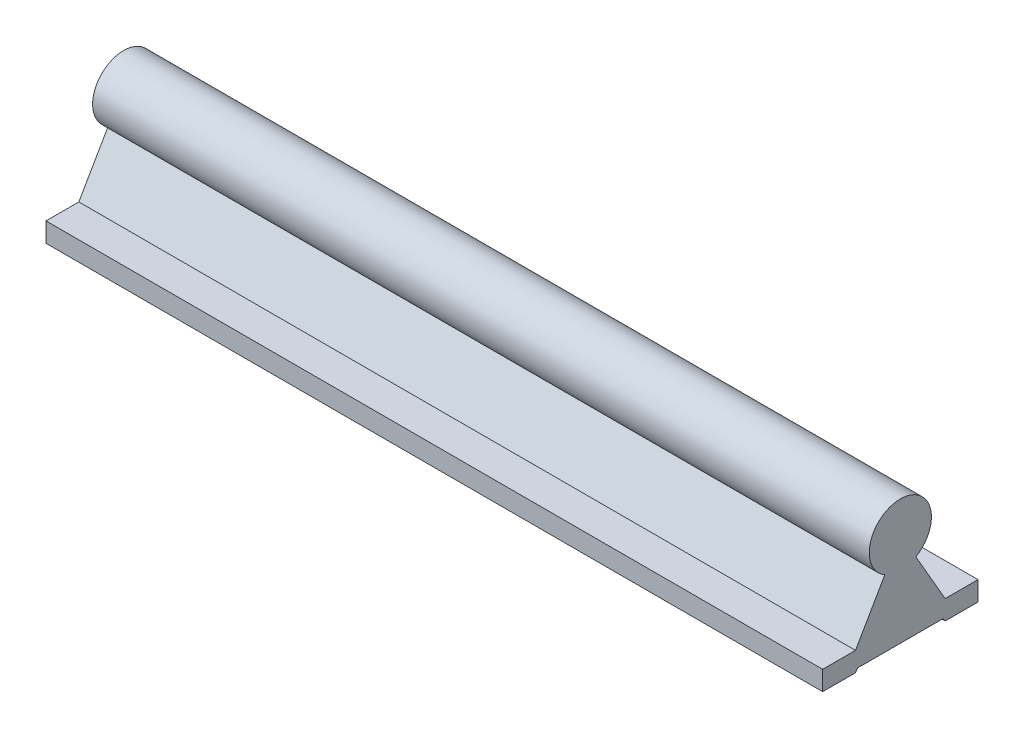
ISO-10303-21;
HEADER;
FILE_DESCRIPTION(('STEP AP214'),'2;1');
FILE_NAME('part.step','',(''),(''),'','','');
FILE_SCHEMA(('AUTOMOTIVE_DESIGN { 1 0 10303 214 1 1 1 1 }'));
ENDSEC;
DATA;
#1=APPLICATION_CONTEXT('core data for automotive mechanical design processes');
#2=APPLICATION_PROTOCOL_DEFINITION('international standard','automotive_design',2000,#1);
#3=PRODUCT_CONTEXT('',#1,'mechanical');
#4=PRODUCT('Part','Part','',(#3));
#5=PRODUCT_RELATED_PRODUCT_CATEGORY('part','',(#4));
#6=PRODUCT_DEFINITION_FORMATION('','',#4);
#7=PRODUCT_DEFINITION_CONTEXT('part definition',#1,'design');
#8=PRODUCT_DEFINITION('design','',#6,#7);
#9=PRODUCT_DEFINITION_SHAPE('','',#8);
#10=(LENGTH_UNIT() NAMED_UNIT(*) SI_UNIT(.MILLI.,.METRE.));
#11=(NAMED_UNIT(*) PLANE_ANGLE_UNIT() SI_UNIT($,.RADIAN.));
#12=(NAMED_UNIT(*) SI_UNIT($,.STERADIAN.) SOLID_ANGLE_UNIT());
#13=UNCERTAINTY_MEASURE_WITH_UNIT(LENGTH_MEASURE(1.E-05),#10,'distance_accuracy_value','');
#14=(GEOMETRIC_REPRESENTATION_CONTEXT(3) GLOBAL_UNCERTAINTY_ASSIGNED_CONTEXT((#13)) GLOBAL_UNIT_ASSIGNED_CONTEXT((#10,
#11,#12)) REPRESENTATION_CONTEXT('',''));
#15=CARTESIAN_POINT('',(0.,0.,0.));
#16=DIRECTION('',(0.,0.,1.));
#17=DIRECTION('',(1.,0.,0.));
#18=AXIS2_PLACEMENT_3D('',#15,#16,#17);
#19=CARTESIAN_POINT('',(200.,-20.,11.5470053837925));
#20=DIRECTION('',(0.,0.5,0.866025403784438));
#21=DIRECTION('',(0.,-0.866025403784439,0.5));
#22=AXIS2_PLACEMENT_3D('',#19,#20,#21);
#23=PLANE('',#22);
#24=DIRECTION('',(0.,0.866025403784438,-0.5));
#25=VECTOR('',#24,1.);
#26=CARTESIAN_POINT('',(0.,-20.,11.5470053837925));
#27=LINE('',#26,#25);
#28=CARTESIAN_POINT('',(0.,-20.,11.5470053837925));
#29=VERTEX_POINT('',#28);
#30=CARTESIAN_POINT('',(0.,-6.9282032302755,4.00000000000001));
#31=VERTEX_POINT('',#30);
#32=EDGE_CURVE('E162',#29,#31,#27,.T.);
#33=ORIENTED_EDGE('',*,*,#32,.F.);
#34=DIRECTION('',(-1.,0.,0.));
#35=VECTOR('',#34,1.);
#36=CARTESIAN_POINT('',(200.,-20.,11.5470053837925));
#37=LINE('',#36,#35);
#38=CARTESIAN_POINT('',(200.,-20.,11.5470053837925));
#39=VERTEX_POINT('',#38);
#40=EDGE_CURVE('E11',#39,#29,#37,.T.);
#41=ORIENTED_EDGE('',*,*,#40,.F.);
#42=DIRECTION('',(0.,0.866025403784438,-0.5));
#43=VECTOR('',#42,1.);
#44=CARTESIAN_POINT('',(200.,-20.,11.5470053837925));
#45=LINE('',#44,#43);
#46=CARTESIAN_POINT('',(200.,-6.9282032302755,4.00000000000001));
#47=VERTEX_POINT('',#46);
#48=EDGE_CURVE('E202',#39,#47,#45,.T.);
#49=ORIENTED_EDGE('',*,*,#48,.T.);
#50=DIRECTION('',(-1.,0.,0.));
#51=VECTOR('',#50,1.);
#52=CARTESIAN_POINT('',(200.,-6.9282032302755,4.00000000000001));
#53=LINE('',#52,#51);
#54=EDGE_CURVE('E42',#47,#31,#53,.T.);
#55=ORIENTED_EDGE('',*,*,#54,.T.);
#56=EDGE_LOOP('',(#33,#41,#49,#55));
#57=FACE_BOUND('',#56,.T.);
#58=ADVANCED_FACE('F39',(#57),#23,.T.);
#59=CARTESIAN_POINT('',(200.,-20.,20.));
#60=DIRECTION('',(0.,1.,0.));
#61=DIRECTION('',(0.,0.,1.));
#62=AXIS2_PLACEMENT_3D('',#59,#60,#61);
#63=PLANE('',#62);
#64=DIRECTION('',(0.,0.,-1.));
#65=VECTOR('',#64,1.);
#66=CARTESIAN_POINT('',(0.,-20.,20.));
#67=LINE('',#66,#65);
#68=CARTESIAN_POINT('',(0.,-20.,20.));
#69=VERTEX_POINT('',#68);
#70=EDGE_CURVE('E199',#69,#29,#67,.T.);
#71=ORIENTED_EDGE('',*,*,#70,.F.);
#72=DIRECTION('',(-1.,0.,0.));
#73=VECTOR('',#72,1.);
#74=CARTESIAN_POINT('',(200.,-20.,20.));
#75=LINE('',#74,#73);
#76=CARTESIAN_POINT('',(200.,-20.,20.));
#77=VERTEX_POINT('',#76);
#78=EDGE_CURVE('E49',#77,#69,#75,.T.);
#79=ORIENTED_EDGE('',*,*,#78,.F.);
#80=DIRECTION('',(0.,0.,-1.));
#81=VECTOR('',#80,1.);
#82=CARTESIAN_POINT('',(200.,-20.,20.));
#83=LINE('',#82,#81);
#84=EDGE_CURVE('E155',#77,#39,#83,.T.);
#85=ORIENTED_EDGE('',*,*,#84,.T.);
#86=ORIENTED_EDGE('',*,*,#40,.T.);
#87=EDGE_LOOP('',(#71,#79,#85,#86));
#88=FACE_BOUND('',#87,.T.);
#89=ADVANCED_FACE('F237',(#88),#63,.T.);
#90=CARTESIAN_POINT('',(200.,-25.,20.));
#91=DIRECTION('',(0.,0.,1.));
#92=DIRECTION('',(1.,0.,0.));
#93=AXIS2_PLACEMENT_3D('',#90,#91,#92);
#94=PLANE('',#93);
#95=DIRECTION('',(0.,1.,0.));
#96=VECTOR('',#95,1.);
#97=CARTESIAN_POINT('',(0.,-25.,20.));
#98=LINE('',#97,#96);
#99=CARTESIAN_POINT('',(0.,-25.,20.));
#100=VERTEX_POINT('',#99);
#101=EDGE_CURVE('E139',#100,#69,#98,.T.);
#102=ORIENTED_EDGE('',*,*,#101,.F.);
#103=DIRECTION('',(-1.,0.,0.));
#104=VECTOR('',#103,1.);
#105=CARTESIAN_POINT('',(200.,-25.,20.));
#106=LINE('',#105,#104);
#107=CARTESIAN_POINT('',(200.,-25.,20.));
#108=VERTEX_POINT('',#107);
#109=EDGE_CURVE('E133',#108,#100,#106,.T.);
#110=ORIENTED_EDGE('',*,*,#109,.F.);
#111=DIRECTION('',(0.,1.,0.));
#112=VECTOR('',#111,1.);
#113=CARTESIAN_POINT('',(200.,-25.,20.));
#114=LINE('',#113,#112);
#115=EDGE_CURVE('E137',#108,#77,#114,.T.);
#116=ORIENTED_EDGE('',*,*,#115,.T.);
#117=ORIENTED_EDGE('',*,*,#78,.T.);
#118=EDGE_LOOP('',(#102,#110,#116,#117));
#119=FACE_BOUND('',#118,.T.);
#120=ADVANCED_FACE('F135',(#119),#94,.T.);
#121=CARTESIAN_POINT('',(200.,-25.,20.));
#122=DIRECTION('',(0.,1.,0.));
#123=DIRECTION('',(0.,0.,1.));
#124=AXIS2_PLACEMENT_3D('',#121,#122,#123);
#125=PLANE('',#124);
#126=DIRECTION('',(0.,0.,-1.));
#127=VECTOR('',#126,1.);
#128=CARTESIAN_POINT('',(0.,-25.,20.));
#129=LINE('',#128,#127);
#130=CARTESIAN_POINT('',(0.,-25.,11.5470053837925));
#131=VERTEX_POINT('',#130);
#132=EDGE_CURVE('E194',#100,#131,#129,.T.);
#133=ORIENTED_EDGE('',*,*,#132,.T.);
#134=DIRECTION('',(-1.,0.,0.));
#135=VECTOR('',#134,1.);
#136=CARTESIAN_POINT('',(200.,-25.,11.5470053837925));
#137=LINE('',#136,#135);
#138=CARTESIAN_POINT('',(200.,-25.,11.5470053837925));
#139=VERTEX_POINT('',#138);
#140=EDGE_CURVE('E143',#139,#131,#137,.T.);
#141=ORIENTED_EDGE('',*,*,#140,.F.);
#142=DIRECTION('',(0.,0.,-1.));
#143=VECTOR('',#142,1.);
#144=CARTESIAN_POINT('',(200.,-25.,20.));
#145=LINE('',#144,#143);
#146=EDGE_CURVE('E146',#108,#139,#145,.T.);
#147=ORIENTED_EDGE('',*,*,#146,.F.);
#148=ORIENTED_EDGE('',*,*,#109,.T.);
#149=EDGE_LOOP('',(#133,#141,#147,#148));
#150=FACE_BOUND('',#149,.T.);
#151=ADVANCED_FACE('F147',(#150),#125,.F.);
#152=CARTESIAN_POINT('',(200.,-25.,11.5470053837925));
#153=DIRECTION('',(0.,0.565954595824354,0.824436410807584));
#154=DIRECTION('',(0.,-0.824436410807584,0.565954595824354));
#155=AXIS2_PLACEMENT_3D('',#152,#153,#154);
#156=PLANE('',#155);
#157=DIRECTION('',(0.,0.824436410807584,-0.565954595824354));
#158=VECTOR('',#157,1.);
#159=CARTESIAN_POINT('',(0.,-25.,11.5470053837925));
#160=LINE('',#159,#158);
#161=CARTESIAN_POINT('',(0.,-24.2,10.9978257615389));
#162=VERTEX_POINT('',#161);
#163=EDGE_CURVE('E191',#131,#162,#160,.T.);
#164=ORIENTED_EDGE('',*,*,#163,.T.);
#165=DIRECTION('',(-1.,0.,0.));
#166=VECTOR('',#165,1.);
#167=CARTESIAN_POINT('',(200.,-24.2,10.9978257615389));
#168=LINE('',#167,#166);
#169=CARTESIAN_POINT('',(200.,-24.2,10.9978257615389));
#170=VERTEX_POINT('',#169);
#171=EDGE_CURVE('E208',#170,#162,#168,.T.);
#172=ORIENTED_EDGE('',*,*,#171,.F.);
#173=DIRECTION('',(0.,0.824436410807584,-0.565954595824354));
#174=VECTOR('',#173,1.);
#175=CARTESIAN_POINT('',(200.,-25.,11.5470053837925));
#176=LINE('',#175,#174);
#177=EDGE_CURVE('E152',#139,#170,#176,.T.);
#178=ORIENTED_EDGE('',*,*,#177,.F.);
#179=ORIENTED_EDGE('',*,*,#140,.T.);
#180=EDGE_LOOP('',(#164,#172,#178,#179));
#181=FACE_BOUND('',#180,.T.);
#182=ADVANCED_FACE('F250',(#181),#156,.F.);
#183=CARTESIAN_POINT('',(200.,-24.2,10.9978257615389));
#184=DIRECTION('',(0.,1.,0.));
#185=DIRECTION('',(0.,0.,1.));
#186=AXIS2_PLACEMENT_3D('',#183,#184,#185);
#187=PLANE('',#186);
#188=DIRECTION('',(0.,0.,-1.));
#189=VECTOR('',#188,1.);
#190=CARTESIAN_POINT('',(0.,-24.2,10.9978257615389));
#191=LINE('',#190,#189);
#192=CARTESIAN_POINT('',(0.,-24.2,-10.9978257615389));
#193=VERTEX_POINT('',#192);
#194=EDGE_CURVE('E188',#162,#193,#191,.T.);
#195=ORIENTED_EDGE('',*,*,#194,.T.);
#196=DIRECTION('',(-1.,0.,0.));
#197=VECTOR('',#196,1.);
#198=CARTESIAN_POINT('',(200.,-24.2,-10.9978257615389));
#199=LINE('',#198,#197);
#200=CARTESIAN_POINT('',(200.,-24.2,-10.9978257615389));
#201=VERTEX_POINT('',#200);
#202=EDGE_CURVE('E212',#201,#193,#199,.T.);
#203=ORIENTED_EDGE('',*,*,#202,.F.);
#204=DIRECTION('',(0.,0.,-1.));
#205=VECTOR('',#204,1.);
#206=CARTESIAN_POINT('',(200.,-24.2,10.9978257615389));
#207=LINE('',#206,#205);
#208=EDGE_CURVE('E381',#170,#201,#207,.T.);
#209=ORIENTED_EDGE('',*,*,#208,.F.);
#210=ORIENTED_EDGE('',*,*,#171,.T.);
#211=EDGE_LOOP('',(#195,#203,#209,#210));
#212=FACE_BOUND('',#211,.T.);
#213=ADVANCED_FACE('F253',(#212),#187,.F.);
#214=CARTESIAN_POINT('',(200.,-24.2,-10.9978257615389));
#215=DIRECTION('',(0.,0.565954595824363,-0.824436410807579));
#216=DIRECTION('',(0.,0.824436410807579,0.565954595824363));
#217=AXIS2_PLACEMENT_3D('',#214,#215,#216);
#218=PLANE('',#217);
#219=DIRECTION('',(0.,-0.824436410807579,-0.565954595824363));
#220=VECTOR('',#219,1.);
#221=CARTESIAN_POINT('',(0.,-24.2,-10.9978257615389));
#222=LINE('',#221,#220);
#223=CARTESIAN_POINT('',(0.,-25.,-11.5470053837925));
#224=VERTEX_POINT('',#223);
#225=EDGE_CURVE('E185',#193,#224,#222,.T.);
#226=ORIENTED_EDGE('',*,*,#225,.T.);
#227=DIRECTION('',(-1.,0.,0.));
#228=VECTOR('',#227,1.);
#229=CARTESIAN_POINT('',(200.,-25.,-11.5470053837925));
#230=LINE('',#229,#228);
#231=CARTESIAN_POINT('',(200.,-25.,-11.5470053837925));
#232=VERTEX_POINT('',#231);
#233=EDGE_CURVE('E216',#232,#224,#230,.T.);
#234=ORIENTED_EDGE('',*,*,#233,.F.);
#235=DIRECTION('',(0.,-0.824436410807579,-0.565954595824363));
#236=VECTOR('',#235,1.);
#237=CARTESIAN_POINT('',(200.,-24.2,-10.9978257615389));
#238=LINE('',#237,#236);
#239=EDGE_CURVE('E378',#201,#232,#238,.T.);
#240=ORIENTED_EDGE('',*,*,#239,.F.);
#241=ORIENTED_EDGE('',*,*,#202,.T.);
#242=EDGE_LOOP('',(#226,#234,#240,#241));
#243=FACE_BOUND('',#242,.T.);
#244=ADVANCED_FACE('F257',(#243),#218,.F.);
#245=CARTESIAN_POINT('',(200.,-25.,-11.5470053837925));
#246=DIRECTION('',(0.,1.,0.));
#247=DIRECTION('',(0.,0.,1.));
#248=AXIS2_PLACEMENT_3D('',#245,#246,#247);
#249=PLANE('',#248);
#250=DIRECTION('',(0.,0.,-1.));
#251=VECTOR('',#250,1.);
#252=CARTESIAN_POINT('',(0.,-25.,-11.5470053837925));
#253=LINE('',#252,#251);
#254=CARTESIAN_POINT('',(0.,-25.,-20.));
#255=VERTEX_POINT('',#254);
#256=EDGE_CURVE('E182',#224,#255,#253,.T.);
#257=ORIENTED_EDGE('',*,*,#256,.T.);
#258=DIRECTION('',(-1.,0.,0.));
#259=VECTOR('',#258,1.);
#260=CARTESIAN_POINT('',(200.,-25.,-20.));
#261=LINE('',#260,#259);
#262=CARTESIAN_POINT('',(200.,-25.,-20.));
#263=VERTEX_POINT('',#262);
#264=EDGE_CURVE('E220',#263,#255,#261,.T.);
#265=ORIENTED_EDGE('',*,*,#264,.F.);
#266=DIRECTION('',(0.,0.,-1.));
#267=VECTOR('',#266,1.);
#268=CARTESIAN_POINT('',(200.,-25.,-11.5470053837925));
#269=LINE('',#268,#267);
#270=EDGE_CURVE('E376',#232,#263,#269,.T.);
#271=ORIENTED_EDGE('',*,*,#270,.F.);
#272=ORIENTED_EDGE('',*,*,#233,.T.);
#273=EDGE_LOOP('',(#257,#265,#271,#272));
#274=FACE_BOUND('',#273,.T.);
#275=ADVANCED_FACE('F261',(#274),#249,.F.);
#276=CARTESIAN_POINT('',(200.,-25.,-20.));
#277=DIRECTION('',(0.,0.,1.));
#278=DIRECTION('',(1.,0.,0.));
#279=AXIS2_PLACEMENT_3D('',#276,#277,#278);
#280=PLANE('',#279);
#281=DIRECTION('',(0.,1.,0.));
#282=VECTOR('',#281,1.);
#283=CARTESIAN_POINT('',(0.,-25.,-20.));
#284=LINE('',#283,#282);
#285=CARTESIAN_POINT('',(0.,-20.,-20.));
#286=VERTEX_POINT('',#285);
#287=EDGE_CURVE('E178',#255,#286,#284,.T.);
#288=ORIENTED_EDGE('',*,*,#287,.T.);
#289=DIRECTION('',(-1.,0.,0.));
#290=VECTOR('',#289,1.);
#291=CARTESIAN_POINT('',(200.,-20.,-20.));
#292=LINE('',#291,#290);
#293=CARTESIAN_POINT('',(200.,-20.,-20.));
#294=VERTEX_POINT('',#293);
#295=EDGE_CURVE('E224',#294,#286,#292,.T.);
#296=ORIENTED_EDGE('',*,*,#295,.F.);
#297=DIRECTION('',(0.,1.,0.));
#298=VECTOR('',#297,1.);
#299=CARTESIAN_POINT('',(200.,-25.,-20.));
#300=LINE('',#299,#298);
#301=EDGE_CURVE('E392',#263,#294,#300,.T.);
#302=ORIENTED_EDGE('',*,*,#301,.F.);
#303=ORIENTED_EDGE('',*,*,#264,.T.);
#304=EDGE_LOOP('',(#288,#296,#302,#303));
#305=FACE_BOUND('',#304,.T.);
#306=ADVANCED_FACE('F265',(#305),#280,.F.);
#307=CARTESIAN_POINT('',(200.,-20.,-11.5470053837926));
#308=DIRECTION('',(0.,1.,0.));
#309=DIRECTION('',(0.,0.,1.));
#310=AXIS2_PLACEMENT_3D('',#307,#308,#309);
#311=PLANE('',#310);
#312=DIRECTION('',(0.,0.,-1.));
#313=VECTOR('',#312,1.);
#314=CARTESIAN_POINT('',(0.,-20.,-11.5470053837926));
#315=LINE('',#314,#313);
#316=CARTESIAN_POINT('',(0.,-20.,-11.5470053837926));
#317=VERTEX_POINT('',#316);
#318=EDGE_CURVE('E174',#317,#286,#315,.T.);
#319=ORIENTED_EDGE('',*,*,#318,.F.);
#320=DIRECTION('',(-1.,0.,0.));
#321=VECTOR('',#320,1.);
#322=CARTESIAN_POINT('',(200.,-20.,-11.5470053837926));
#323=LINE('',#322,#321);
#324=CARTESIAN_POINT('',(200.,-20.,-11.5470053837926));
#325=VERTEX_POINT('',#324);
#326=EDGE_CURVE('E227',#325,#317,#323,.T.);
#327=ORIENTED_EDGE('',*,*,#326,.F.);
#328=DIRECTION('',(0.,0.,-1.));
#329=VECTOR('',#328,1.);
#330=CARTESIAN_POINT('',(200.,-20.,-11.5470053837926));
#331=LINE('',#330,#329);
#332=EDGE_CURVE('E368',#325,#294,#331,.T.);
#333=ORIENTED_EDGE('',*,*,#332,.T.);
#334=ORIENTED_EDGE('',*,*,#295,.T.);
#335=EDGE_LOOP('',(#319,#327,#333,#334));
#336=FACE_BOUND('',#335,.T.);
#337=ADVANCED_FACE('F269',(#336),#311,.T.);
#338=CARTESIAN_POINT('',(200.,-20.,-11.5470053837926));
#339=DIRECTION('',(0.,-0.500000000000002,0.866025403784437));
#340=DIRECTION('',(0.,-0.866025403784437,-0.500000000000002));
#341=AXIS2_PLACEMENT_3D('',#338,#339,#340);
#342=PLANE('',#341);
#343=DIRECTION('',(0.,0.866025403784437,0.500000000000002));
#344=VECTOR('',#343,1.);
#345=CARTESIAN_POINT('',(0.,-20.,-11.5470053837926));
#346=LINE('',#345,#344);
#347=CARTESIAN_POINT('',(0.,-6.9282032302755,-4.00000000000001));
#348=VERTEX_POINT('',#347);
#349=EDGE_CURVE('E170',#317,#348,#346,.T.);
#350=ORIENTED_EDGE('',*,*,#349,.T.);
#351=DIRECTION('',(-1.,0.,0.));
#352=VECTOR('',#351,1.);
#353=CARTESIAN_POINT('',(200.,-6.9282032302755,-4.00000000000001));
#354=LINE('',#353,#352);
#355=CARTESIAN_POINT('',(200.,-6.9282032302755,-4.00000000000001));
#356=VERTEX_POINT('',#355);
#357=EDGE_CURVE('E229',#356,#348,#354,.T.);
#358=ORIENTED_EDGE('',*,*,#357,.F.);
#359=DIRECTION('',(0.,0.866025403784437,0.500000000000002));
#360=VECTOR('',#359,1.);
#361=CARTESIAN_POINT('',(200.,-20.,-11.5470053837926));
#362=LINE('',#361,#360);
#363=EDGE_CURVE('E397',#325,#356,#362,.T.);
#364=ORIENTED_EDGE('',*,*,#363,.F.);
#365=ORIENTED_EDGE('',*,*,#326,.T.);
#366=EDGE_LOOP('',(#350,#358,#364,#365));
#367=FACE_BOUND('',#366,.T.);
#368=ADVANCED_FACE('F273',(#367),#342,.F.);
#369=CARTESIAN_POINT('',(200.,0.,0.));
#370=DIRECTION('',(-1.,0.,0.));
#371=DIRECTION('',(0.,0.,1.));
#372=AXIS2_PLACEMENT_3D('',#369,#370,#371);
#373=CYLINDRICAL_SURFACE('',#372,8.);
#374=CARTESIAN_POINT('',(0.,0.,0.));
#375=DIRECTION('',(-1.,0.,0.));
#376=DIRECTION('',(0.,0.,1.));
#377=AXIS2_PLACEMENT_3D('',#374,#375,#376);
#378=CIRCLE('',#377,8.);
#379=EDGE_CURVE('E166',#31,#348,#378,.T.);
#380=ORIENTED_EDGE('',*,*,#379,.F.);
#381=ORIENTED_EDGE('',*,*,#54,.F.);
#382=CARTESIAN_POINT('',(200.,0.,0.));
#383=DIRECTION('',(-1.,0.,0.));
#384=DIRECTION('',(0.,0.,1.));
#385=AXIS2_PLACEMENT_3D('',#382,#383,#384);
#386=CIRCLE('',#385,8.);
#387=EDGE_CURVE('E400',#47,#356,#386,.T.);
#388=ORIENTED_EDGE('',*,*,#387,.T.);
#389=ORIENTED_EDGE('',*,*,#357,.T.);
#390=EDGE_LOOP('',(#380,#381,#388,#389));
#391=FACE_BOUND('',#390,.T.);
#392=ADVANCED_FACE('F233',(#391),#373,.T.);
#393=CARTESIAN_POINT('',(200.,0.,0.));
#394=DIRECTION('',(-1.,0.,0.));
#395=DIRECTION('',(0.,0.,1.));
#396=AXIS2_PLACEMENT_3D('',#393,#394,#395);
#397=PLANE('',#396);
#398=ORIENTED_EDGE('',*,*,#48,.F.);
#399=ORIENTED_EDGE('',*,*,#84,.F.);
#400=ORIENTED_EDGE('',*,*,#115,.F.);
#401=ORIENTED_EDGE('',*,*,#146,.T.);
#402=ORIENTED_EDGE('',*,*,#177,.T.);
#403=ORIENTED_EDGE('',*,*,#208,.T.);
#404=ORIENTED_EDGE('',*,*,#239,.T.);
#405=ORIENTED_EDGE('',*,*,#270,.T.);
#406=ORIENTED_EDGE('',*,*,#301,.T.);
#407=ORIENTED_EDGE('',*,*,#332,.F.);
#408=ORIENTED_EDGE('',*,*,#363,.T.);
#409=ORIENTED_EDGE('',*,*,#387,.F.);
#410=EDGE_LOOP('',(#398,#399,#400,#401,#402,#403,#404,#405,#406,#407,#408,#409));
#411=FACE_BOUND('',#410,.T.);
#412=ADVANCED_FACE('F154',(#411),#397,.F.);
#413=CARTESIAN_POINT('',(0.,0.,0.));
#414=DIRECTION('',(-1.,0.,0.));
#415=DIRECTION('',(0.,0.,1.));
#416=AXIS2_PLACEMENT_3D('',#413,#414,#415);
#417=PLANE('',#416);
#418=ORIENTED_EDGE('',*,*,#32,.T.);
#419=ORIENTED_EDGE('',*,*,#379,.T.);
#420=ORIENTED_EDGE('',*,*,#349,.F.);
#421=ORIENTED_EDGE('',*,*,#318,.T.);
#422=ORIENTED_EDGE('',*,*,#287,.F.);
#423=ORIENTED_EDGE('',*,*,#256,.F.);
#424=ORIENTED_EDGE('',*,*,#225,.F.);
#425=ORIENTED_EDGE('',*,*,#194,.F.);
#426=ORIENTED_EDGE('',*,*,#163,.F.);
#427=ORIENTED_EDGE('',*,*,#132,.F.);
#428=ORIENTED_EDGE('',*,*,#101,.T.);
#429=ORIENTED_EDGE('',*,*,#70,.T.);
#430=EDGE_LOOP('',(#418,#419,#420,#421,#422,#423,#424,#425,#426,#427,#428,#429));
#431=FACE_BOUND('',#430,.T.);
#432=ADVANCED_FACE('F236',(#431),#417,.T.);
#433=CLOSED_SHELL('',(#58,#89,#120,#151,#182,#213,#244,#275,#306,#337,#368,#392,#412,#432));
#434=MANIFOLD_SOLID_BREP('B2',#433);
#435=ADVANCED_BREP_SHAPE_REPRESENTATION('',(#18,#434),#14);
#436=SHAPE_DEFINITION_REPRESENTATION(#9,#435);
ENDSEC;
END-ISO-10303-21;
